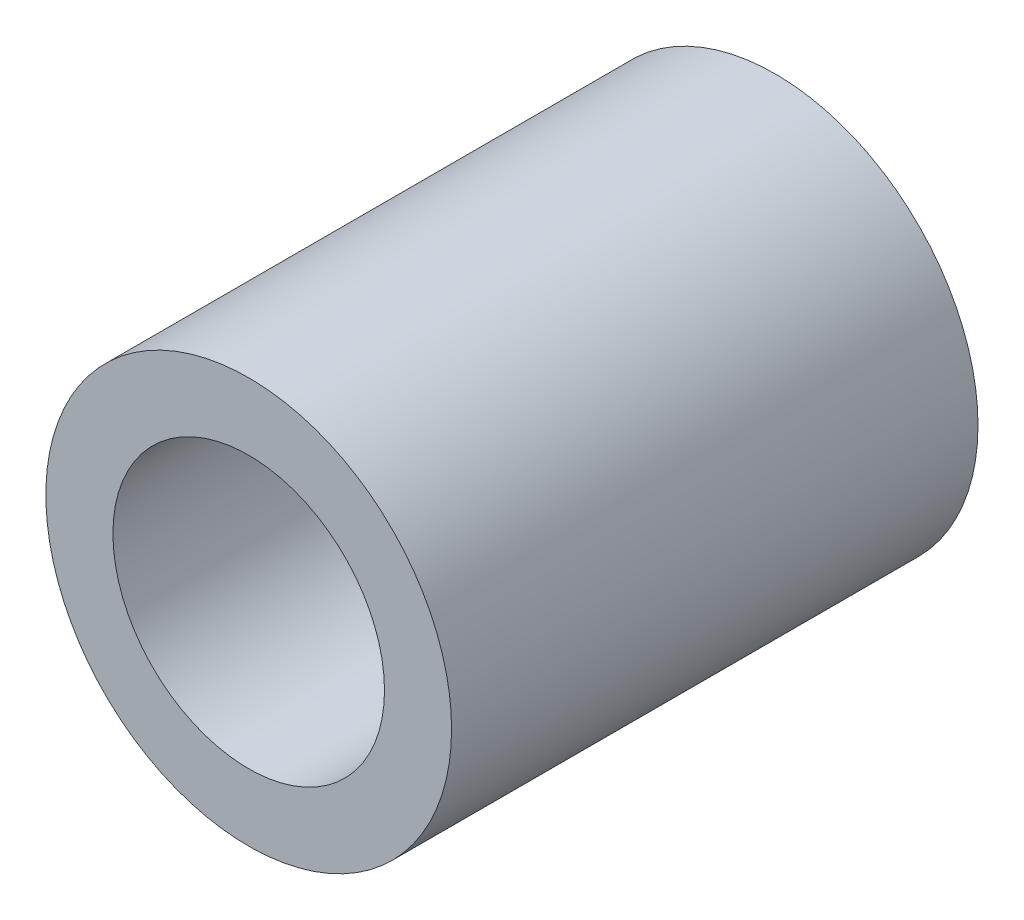
ISO-10303-21;
HEADER;
FILE_DESCRIPTION(('STEP AP214'),'2;1');
FILE_NAME('part.step','',(''),(''),'','','');
FILE_SCHEMA(('AUTOMOTIVE_DESIGN { 1 0 10303 214 1 1 1 1 }'));
ENDSEC;
DATA;
#1=APPLICATION_CONTEXT('core data for automotive mechanical design processes');
#2=APPLICATION_PROTOCOL_DEFINITION('international standard','automotive_design',2000,#1);
#3=PRODUCT_CONTEXT('',#1,'mechanical');
#4=PRODUCT('Part','Part','',(#3));
#5=PRODUCT_RELATED_PRODUCT_CATEGORY('part','',(#4));
#6=PRODUCT_DEFINITION_FORMATION('','',#4);
#7=PRODUCT_DEFINITION_CONTEXT('part definition',#1,'design');
#8=PRODUCT_DEFINITION('design','',#6,#7);
#9=PRODUCT_DEFINITION_SHAPE('','',#8);
#10=(LENGTH_UNIT() NAMED_UNIT(*) SI_UNIT(.MILLI.,.METRE.));
#11=(NAMED_UNIT(*) PLANE_ANGLE_UNIT() SI_UNIT($,.RADIAN.));
#12=(NAMED_UNIT(*) SI_UNIT($,.STERADIAN.) SOLID_ANGLE_UNIT());
#13=UNCERTAINTY_MEASURE_WITH_UNIT(LENGTH_MEASURE(1.E-05),#10,'distance_accuracy_value','');
#14=(GEOMETRIC_REPRESENTATION_CONTEXT(3) GLOBAL_UNCERTAINTY_ASSIGNED_CONTEXT((#13)) GLOBAL_UNIT_ASSIGNED_CONTEXT((#10,
#11,#12)) REPRESENTATION_CONTEXT('',''));
#15=CARTESIAN_POINT('',(0.,0.,0.));
#16=DIRECTION('',(0.,0.,1.));
#17=DIRECTION('',(1.,0.,0.));
#18=AXIS2_PLACEMENT_3D('',#15,#16,#17);
#19=CARTESIAN_POINT('',(0.,0.,15.7));
#20=DIRECTION('',(0.,0.,1.));
#21=DIRECTION('',(1.,0.,0.));
#22=AXIS2_PLACEMENT_3D('',#19,#20,#21);
#23=PLANE('',#22);
#24=CARTESIAN_POINT('',(0.,0.,15.7));
#25=DIRECTION('',(0.,0.,1.));
#26=DIRECTION('',(1.,0.,0.));
#27=AXIS2_PLACEMENT_3D('',#24,#25,#26);
#28=CIRCLE('',#27,6.05);
#29=CARTESIAN_POINT('',(6.05,0.,15.7));
#30=VERTEX_POINT('',#29);
#31=EDGE_CURVE('E10',#30,#30,#28,.T.);
#32=ORIENTED_EDGE('',*,*,#31,.T.);
#33=EDGE_LOOP('',(#32));
#34=FACE_BOUND('',#33,.T.);
#35=CARTESIAN_POINT('',(0.,0.,15.7));
#36=DIRECTION('',(0.,0.,1.));
#37=DIRECTION('',(1.,0.,0.));
#38=AXIS2_PLACEMENT_3D('',#35,#36,#37);
#39=CIRCLE('',#38,4.05);
#40=CARTESIAN_POINT('',(4.05,0.,15.7));
#41=VERTEX_POINT('',#40);
#42=EDGE_CURVE('E41',#41,#41,#39,.T.);
#43=ORIENTED_EDGE('',*,*,#42,.F.);
#44=EDGE_LOOP('',(#43));
#45=FACE_BOUND('',#44,.T.);
#46=ADVANCED_FACE('F30',(#34,#45),#23,.T.);
#47=CARTESIAN_POINT('',(0.,0.,0.));
#48=DIRECTION('',(0.,0.,1.));
#49=DIRECTION('',(1.,0.,0.));
#50=AXIS2_PLACEMENT_3D('',#47,#48,#49);
#51=PLANE('',#50);
#52=CARTESIAN_POINT('',(0.,0.,0.));
#53=DIRECTION('',(0.,0.,1.));
#54=DIRECTION('',(1.,0.,0.));
#55=AXIS2_PLACEMENT_3D('',#52,#53,#54);
#56=CIRCLE('',#55,6.05);
#57=CARTESIAN_POINT('',(6.05,0.,0.));
#58=VERTEX_POINT('',#57);
#59=EDGE_CURVE('E34',#58,#58,#56,.T.);
#60=ORIENTED_EDGE('',*,*,#59,.F.);
#61=EDGE_LOOP('',(#60));
#62=FACE_BOUND('',#61,.T.);
#63=CARTESIAN_POINT('',(0.,0.,0.));
#64=DIRECTION('',(0.,0.,1.));
#65=DIRECTION('',(1.,0.,0.));
#66=AXIS2_PLACEMENT_3D('',#63,#64,#65);
#67=CIRCLE('',#66,4.05);
#68=CARTESIAN_POINT('',(4.05,0.,0.));
#69=VERTEX_POINT('',#68);
#70=EDGE_CURVE('E43',#69,#69,#67,.T.);
#71=ORIENTED_EDGE('',*,*,#70,.T.);
#72=EDGE_LOOP('',(#71));
#73=FACE_BOUND('',#72,.T.);
#74=ADVANCED_FACE('F53',(#62,#73),#51,.F.);
#75=CARTESIAN_POINT('',(0.,0.,15.7));
#76=DIRECTION('',(0.,0.,-1.));
#77=DIRECTION('',(-1.,0.,0.));
#78=AXIS2_PLACEMENT_3D('',#75,#76,#77);
#79=CYLINDRICAL_SURFACE('',#78,6.05);
#80=ORIENTED_EDGE('',*,*,#31,.F.);
#81=EDGE_LOOP('',(#80));
#82=FACE_BOUND('',#81,.T.);
#83=ORIENTED_EDGE('',*,*,#59,.T.);
#84=EDGE_LOOP('',(#83));
#85=FACE_BOUND('',#84,.T.);
#86=ADVANCED_FACE('F32',(#82,#85),#79,.T.);
#87=CARTESIAN_POINT('',(0.,0.,15.7));
#88=DIRECTION('',(0.,0.,-1.));
#89=DIRECTION('',(-1.,0.,0.));
#90=AXIS2_PLACEMENT_3D('',#87,#88,#89);
#91=CYLINDRICAL_SURFACE('',#90,4.05);
#92=ORIENTED_EDGE('',*,*,#42,.T.);
#93=EDGE_LOOP('',(#92));
#94=FACE_BOUND('',#93,.T.);
#95=ORIENTED_EDGE('',*,*,#70,.F.);
#96=EDGE_LOOP('',(#95));
#97=FACE_BOUND('',#96,.T.);
#98=ADVANCED_FACE('F49',(#94,#97),#91,.F.);
#99=CLOSED_SHELL('',(#46,#74,#86,#98));
#100=MANIFOLD_SOLID_BREP('B2',#99);
#101=ADVANCED_BREP_SHAPE_REPRESENTATION('',(#18,#100),#14);
#102=SHAPE_DEFINITION_REPRESENTATION(#9,#101);
ENDSEC;
END-ISO-10303-21;
